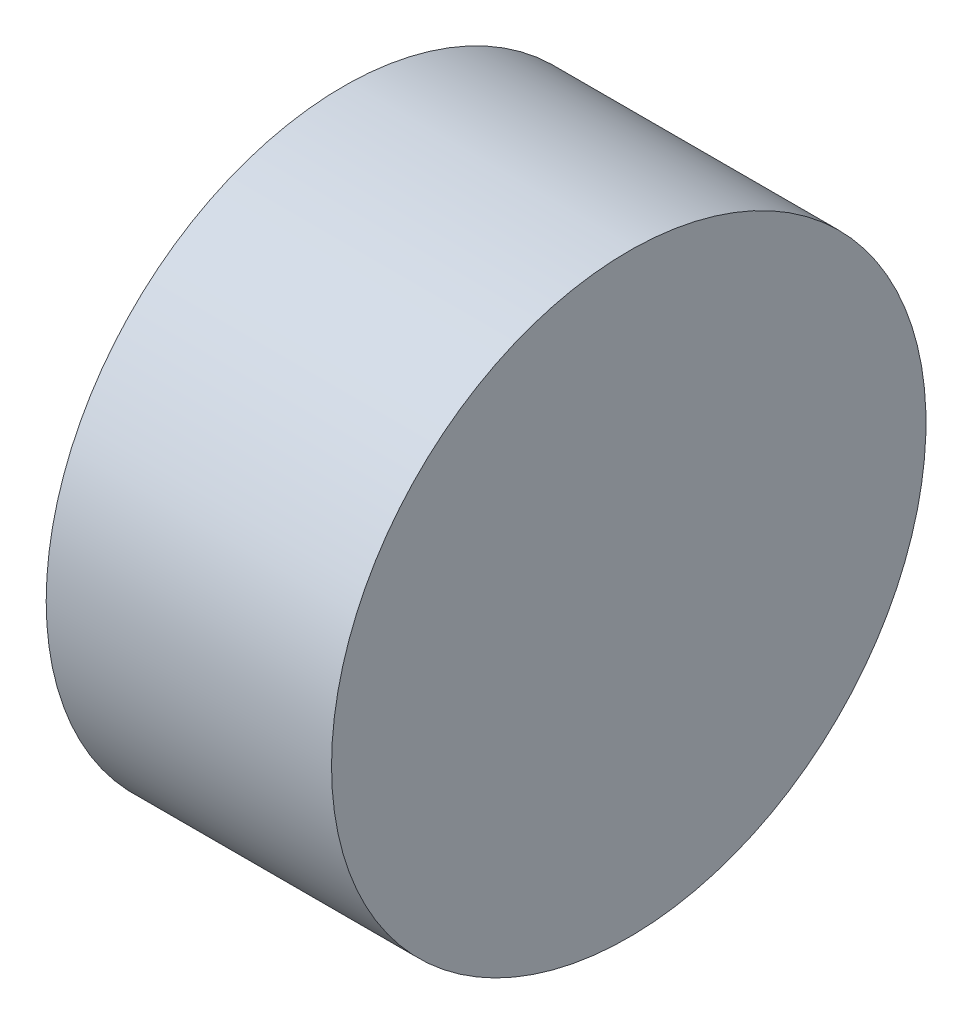
ISO-10303-21;
HEADER;
FILE_DESCRIPTION(('STEP AP214'),'2;1');
FILE_NAME('part.step','',(''),(''),'','','');
FILE_SCHEMA(('AUTOMOTIVE_DESIGN { 1 0 10303 214 1 1 1 1 }'));
ENDSEC;
DATA;
#1=APPLICATION_CONTEXT('core data for automotive mechanical design processes');
#2=APPLICATION_PROTOCOL_DEFINITION('international standard','automotive_design',2000,#1);
#3=PRODUCT_CONTEXT('',#1,'mechanical');
#4=PRODUCT('Part','Part','',(#3));
#5=PRODUCT_RELATED_PRODUCT_CATEGORY('part','',(#4));
#6=PRODUCT_DEFINITION_FORMATION('','',#4);
#7=PRODUCT_DEFINITION_CONTEXT('part definition',#1,'design');
#8=PRODUCT_DEFINITION('design','',#6,#7);
#9=PRODUCT_DEFINITION_SHAPE('','',#8);
#10=(LENGTH_UNIT() NAMED_UNIT(*) SI_UNIT(.MILLI.,.METRE.));
#11=(NAMED_UNIT(*) PLANE_ANGLE_UNIT() SI_UNIT($,.RADIAN.));
#12=(NAMED_UNIT(*) SI_UNIT($,.STERADIAN.) SOLID_ANGLE_UNIT());
#13=UNCERTAINTY_MEASURE_WITH_UNIT(LENGTH_MEASURE(1.E-05),#10,'distance_accuracy_value','');
#14=(GEOMETRIC_REPRESENTATION_CONTEXT(3) GLOBAL_UNCERTAINTY_ASSIGNED_CONTEXT((#13)) GLOBAL_UNIT_ASSIGNED_CONTEXT((#10,
#11,#12)) REPRESENTATION_CONTEXT('',''));
#15=CARTESIAN_POINT('',(0.,0.,0.));
#16=DIRECTION('',(0.,0.,1.));
#17=DIRECTION('',(1.,0.,0.));
#18=AXIS2_PLACEMENT_3D('',#15,#16,#17);
#19=CARTESIAN_POINT('',(136.07857024628,38.6465896745077,0.));
#20=DIRECTION('',(-1.,0.,0.));
#21=DIRECTION('',(0.,0.,1.));
#22=AXIS2_PLACEMENT_3D('',#19,#20,#21);
#23=PLANE('',#22);
#24=CARTESIAN_POINT('',(136.07857024628,38.6465896745077,0.));
#25=DIRECTION('',(-1.,0.,0.));
#26=DIRECTION('',(0.,0.,1.));
#27=AXIS2_PLACEMENT_3D('',#24,#25,#26);
#28=CIRCLE('',#27,6.24999999999999);
#29=CARTESIAN_POINT('',(136.07857024628,38.6465896745077,6.24999999999999));
#30=VERTEX_POINT('',#29);
#31=EDGE_CURVE('E10',#30,#30,#28,.T.);
#32=ORIENTED_EDGE('',*,*,#31,.F.);
#33=EDGE_LOOP('',(#32));
#34=FACE_BOUND('',#33,.T.);
#35=ADVANCED_FACE('F35',(#34),#23,.F.);
#36=CARTESIAN_POINT('',(127.000400996308,38.6465896745077,0.));
#37=DIRECTION('',(-1.,0.,0.));
#38=DIRECTION('',(0.,0.,1.));
#39=AXIS2_PLACEMENT_3D('',#36,#37,#38);
#40=CYLINDRICAL_SURFACE('',#39,6.24999999999999);
#41=CARTESIAN_POINT('',(130.07857024628,38.6465896745077,0.));
#42=DIRECTION('',(-1.,0.,0.));
#43=DIRECTION('',(0.,0.,1.));
#44=AXIS2_PLACEMENT_3D('',#41,#42,#43);
#45=CIRCLE('',#44,6.24999999999999);
#46=CARTESIAN_POINT('',(130.07857024628,38.6465896745077,6.24999999999999));
#47=VERTEX_POINT('',#46);
#48=EDGE_CURVE('E41',#47,#47,#45,.T.);
#49=ORIENTED_EDGE('',*,*,#48,.F.);
#50=EDGE_LOOP('',(#49));
#51=FACE_BOUND('',#50,.T.);
#52=ORIENTED_EDGE('',*,*,#31,.T.);
#53=EDGE_LOOP('',(#52));
#54=FACE_BOUND('',#53,.T.);
#55=ADVANCED_FACE('F49',(#51,#54),#40,.T.);
#56=CARTESIAN_POINT('',(130.07857024628,38.6465896745077,0.));
#57=DIRECTION('',(1.,0.,0.));
#58=DIRECTION('',(0.,0.,-1.));
#59=AXIS2_PLACEMENT_3D('',#56,#57,#58);
#60=PLANE('',#59);
#61=ORIENTED_EDGE('',*,*,#48,.T.);
#62=EDGE_LOOP('',(#61));
#63=FACE_BOUND('',#62,.T.);
#64=ADVANCED_FACE('F47',(#63),#60,.F.);
#65=CLOSED_SHELL('',(#35,#55,#64));
#66=MANIFOLD_SOLID_BREP('B2',#65);
#67=ADVANCED_BREP_SHAPE_REPRESENTATION('',(#18,#66),#14);
#68=SHAPE_DEFINITION_REPRESENTATION(#9,#67);
ENDSEC;
END-ISO-10303-21;
